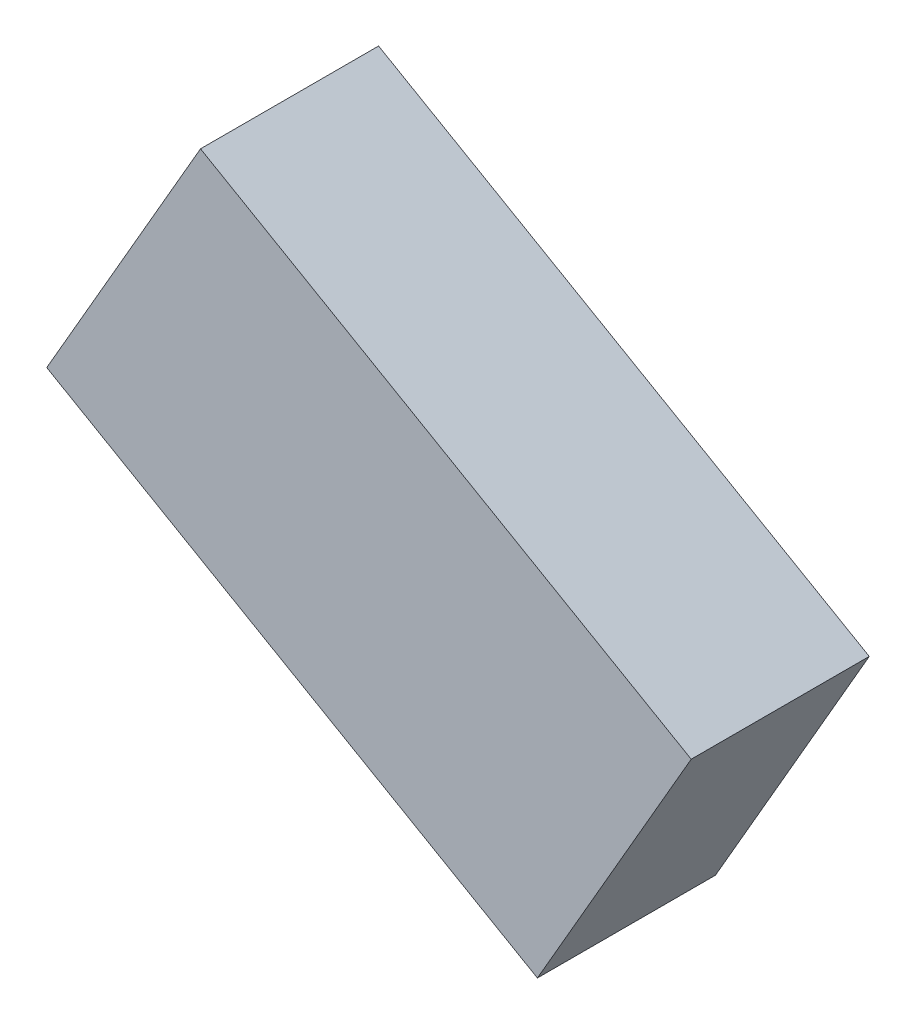
ISO-10303-21;
HEADER;
FILE_DESCRIPTION(('STEP AP214'),'2;1');
FILE_NAME('part.step','',(''),(''),'','','');
FILE_SCHEMA(('AUTOMOTIVE_DESIGN { 1 0 10303 214 1 1 1 1 }'));
ENDSEC;
DATA;
#1=APPLICATION_CONTEXT('core data for automotive mechanical design processes');
#2=APPLICATION_PROTOCOL_DEFINITION('international standard','automotive_design',2000,#1);
#3=PRODUCT_CONTEXT('',#1,'mechanical');
#4=PRODUCT('Part','Part','',(#3));
#5=PRODUCT_RELATED_PRODUCT_CATEGORY('part','',(#4));
#6=PRODUCT_DEFINITION_FORMATION('','',#4);
#7=PRODUCT_DEFINITION_CONTEXT('part definition',#1,'design');
#8=PRODUCT_DEFINITION('design','',#6,#7);
#9=PRODUCT_DEFINITION_SHAPE('','',#8);
#10=(LENGTH_UNIT() NAMED_UNIT(*) SI_UNIT(.MILLI.,.METRE.));
#11=(NAMED_UNIT(*) PLANE_ANGLE_UNIT() SI_UNIT($,.RADIAN.));
#12=(NAMED_UNIT(*) SI_UNIT($,.STERADIAN.) SOLID_ANGLE_UNIT());
#13=UNCERTAINTY_MEASURE_WITH_UNIT(LENGTH_MEASURE(1.E-05),#10,'distance_accuracy_value','');
#14=(GEOMETRIC_REPRESENTATION_CONTEXT(3) GLOBAL_UNCERTAINTY_ASSIGNED_CONTEXT((#13)) GLOBAL_UNIT_ASSIGNED_CONTEXT((#10,
#11,#12)) REPRESENTATION_CONTEXT('',''));
#15=CARTESIAN_POINT('',(0.,0.,0.));
#16=DIRECTION('',(0.,0.,1.));
#17=DIRECTION('',(1.,0.,0.));
#18=AXIS2_PLACEMENT_3D('',#15,#16,#17);
#19=CARTESIAN_POINT('',(-0.99527106,0.0261366,0.5499989));
#20=DIRECTION('',(0.,0.,-1.));
#21=DIRECTION('',(-1.,0.,0.));
#22=AXIS2_PLACEMENT_3D('',#19,#20,#21);
#23=PLANE('',#22);
#24=DIRECTION('',(-0.499998098330148,-0.866026501711256,0.));
#25=VECTOR('',#24,1.);
#26=CARTESIAN_POINT('',(0.52027328,-0.84886292,0.5499989));
#27=LINE('',#26,#25);
#28=CARTESIAN_POINT('',(0.520273280000034,-0.848862919999941,0.5499989));
#29=VERTEX_POINT('',#28);
#30=CARTESIAN_POINT('',(0.995273600000001,-0.0261340600000004,0.5499989));
#31=VERTEX_POINT('',#30);
#32=EDGE_CURVE('E54',#29,#31,#27,.F.);
#33=ORIENTED_EDGE('',*,*,#32,.T.);
#34=DIRECTION('',(0.866026134380101,-0.499998734569058,0.));
#35=VECTOR('',#34,1.);
#36=CARTESIAN_POINT('',(0.9952736,-0.02613406,0.5499989));
#37=LINE('',#36,#35);
#38=CARTESIAN_POINT('',(-0.520270740000045,0.848862919999921,0.5499989));
#39=VERTEX_POINT('',#38);
#40=EDGE_CURVE('E56',#31,#39,#37,.F.);
#41=ORIENTED_EDGE('',*,*,#40,.T.);
#42=DIRECTION('',(0.499999256063104,0.86602583329618,0.));
#43=VECTOR('',#42,1.);
#44=CARTESIAN_POINT('',(-0.52027074,0.84886292,0.5499989));
#45=LINE('',#44,#43);
#46=CARTESIAN_POINT('',(-0.995271059999819,0.0261365999998956,0.5499989));
#47=VERTEX_POINT('',#46);
#48=EDGE_CURVE('E19',#39,#47,#45,.F.);
#49=ORIENTED_EDGE('',*,*,#48,.T.);
#50=DIRECTION('',(-0.866025505893321,0.499999823142186,0.));
#51=VECTOR('',#50,1.);
#52=CARTESIAN_POINT('',(-0.99527106,0.0261366,0.5499989));
#53=LINE('',#52,#51);
#54=EDGE_CURVE('E79',#47,#29,#53,.F.);
#55=ORIENTED_EDGE('',*,*,#54,.T.);
#56=EDGE_LOOP('',(#33,#41,#49,#55));
#57=FACE_BOUND('',#56,.T.);
#58=ADVANCED_FACE('F16',(#57),#23,.F.);
#59=CARTESIAN_POINT('',(-0.52027074,0.84886292,0.));
#60=DIRECTION('',(0.86602583329618,-0.499999256063104,0.));
#61=DIRECTION('',(0.499999256063104,0.86602583329618,0.));
#62=AXIS2_PLACEMENT_3D('',#59,#60,#61);
#63=PLANE('',#62);
#64=DIRECTION('',(0.,0.,1.));
#65=VECTOR('',#64,1.);
#66=CARTESIAN_POINT('',(-0.99527106,0.0261366,0.));
#67=LINE('',#66,#65);
#68=CARTESIAN_POINT('',(-0.995271059999819,0.0261365999998956,0.));
#69=VERTEX_POINT('',#68);
#70=EDGE_CURVE('E67',#69,#47,#67,.T.);
#71=ORIENTED_EDGE('',*,*,#70,.T.);
#72=ORIENTED_EDGE('',*,*,#48,.F.);
#73=DIRECTION('',(0.,0.,1.));
#74=VECTOR('',#73,1.);
#75=CARTESIAN_POINT('',(-0.520270740000182,0.848862919999685,0.));
#76=LINE('',#75,#74);
#77=CARTESIAN_POINT('',(-0.520270740000045,0.848862919999921,0.));
#78=VERTEX_POINT('',#77);
#79=EDGE_CURVE('E62',#39,#78,#76,.F.);
#80=ORIENTED_EDGE('',*,*,#79,.T.);
#81=DIRECTION('',(0.499999256063484,0.86602583329596,0.));
#82=VECTOR('',#81,1.);
#83=CARTESIAN_POINT('',(-0.99527106,0.0261366,0.));
#84=LINE('',#83,#82);
#85=EDGE_CURVE('E82',#69,#78,#84,.T.);
#86=ORIENTED_EDGE('',*,*,#85,.F.);
#87=EDGE_LOOP('',(#71,#72,#80,#86));
#88=FACE_BOUND('',#87,.T.);
#89=ADVANCED_FACE('F64',(#88),#63,.F.);
#90=CARTESIAN_POINT('',(0.9952736,-0.02613406,0.));
#91=DIRECTION('',(-0.499998734569058,-0.866026134380101,0.));
#92=DIRECTION('',(0.866026134380101,-0.499998734569058,0.));
#93=AXIS2_PLACEMENT_3D('',#90,#91,#92);
#94=PLANE('',#93);
#95=ORIENTED_EDGE('',*,*,#79,.F.);
#96=ORIENTED_EDGE('',*,*,#40,.F.);
#97=DIRECTION('',(0.,0.,1.));
#98=VECTOR('',#97,1.);
#99=CARTESIAN_POINT('',(0.995273600000003,-0.0261340600000015,0.));
#100=LINE('',#99,#98);
#101=CARTESIAN_POINT('',(0.995273600000001,-0.0261340600000004,0.));
#102=VERTEX_POINT('',#101);
#103=EDGE_CURVE('E74',#31,#102,#100,.F.);
#104=ORIENTED_EDGE('',*,*,#103,.T.);
#105=DIRECTION('',(0.866026134379997,-0.499998734569238,0.));
#106=VECTOR('',#105,1.);
#107=CARTESIAN_POINT('',(-0.52027074,0.84886292,0.));
#108=LINE('',#107,#106);
#109=EDGE_CURVE('E71',#78,#102,#108,.T.);
#110=ORIENTED_EDGE('',*,*,#109,.F.);
#111=EDGE_LOOP('',(#95,#96,#104,#110));
#112=FACE_BOUND('',#111,.T.);
#113=ADVANCED_FACE('F69',(#112),#94,.F.);
#114=CARTESIAN_POINT('',(0.52027328,-0.84886292,0.));
#115=DIRECTION('',(-0.866026501711256,0.499998098330148,0.));
#116=DIRECTION('',(-0.499998098330148,-0.866026501711256,0.));
#117=AXIS2_PLACEMENT_3D('',#114,#115,#116);
#118=PLANE('',#117);
#119=ORIENTED_EDGE('',*,*,#103,.F.);
#120=ORIENTED_EDGE('',*,*,#32,.F.);
#121=DIRECTION('',(0.,0.,1.));
#122=VECTOR('',#121,1.);
#123=CARTESIAN_POINT('',(0.520273280000137,-0.848862919999764,0.));
#124=LINE('',#123,#122);
#125=CARTESIAN_POINT('',(0.520273280000034,-0.848862919999941,0.));
#126=VERTEX_POINT('',#125);
#127=EDGE_CURVE('E34',#29,#126,#124,.F.);
#128=ORIENTED_EDGE('',*,*,#127,.T.);
#129=DIRECTION('',(-0.499998098330145,-0.866026501711258,0.));
#130=VECTOR('',#129,1.);
#131=CARTESIAN_POINT('',(0.9952736,-0.02613406,0.));
#132=LINE('',#131,#130);
#133=EDGE_CURVE('E25',#102,#126,#132,.T.);
#134=ORIENTED_EDGE('',*,*,#133,.F.);
#135=EDGE_LOOP('',(#119,#120,#128,#134));
#136=FACE_BOUND('',#135,.T.);
#137=ADVANCED_FACE('F88',(#136),#118,.F.);
#138=CARTESIAN_POINT('',(-0.99527106,0.0261366,0.));
#139=DIRECTION('',(0.499999823142186,0.866025505893321,0.));
#140=DIRECTION('',(-0.866025505893321,0.499999823142186,0.));
#141=AXIS2_PLACEMENT_3D('',#138,#139,#140);
#142=PLANE('',#141);
#143=ORIENTED_EDGE('',*,*,#127,.F.);
#144=ORIENTED_EDGE('',*,*,#54,.F.);
#145=ORIENTED_EDGE('',*,*,#70,.F.);
#146=DIRECTION('',(-0.866025505893243,0.499999823142321,0.));
#147=VECTOR('',#146,1.);
#148=CARTESIAN_POINT('',(0.52027328,-0.84886292,0.));
#149=LINE('',#148,#147);
#150=EDGE_CURVE('E11',#126,#69,#149,.T.);
#151=ORIENTED_EDGE('',*,*,#150,.F.);
#152=EDGE_LOOP('',(#143,#144,#145,#151));
#153=FACE_BOUND('',#152,.T.);
#154=ADVANCED_FACE('F90',(#153),#142,.F.);
#155=CARTESIAN_POINT('',(-0.99527106,0.0261366,0.));
#156=DIRECTION('',(0.,0.,-1.));
#157=DIRECTION('',(-1.,0.,0.));
#158=AXIS2_PLACEMENT_3D('',#155,#156,#157);
#159=PLANE('',#158);
#160=ORIENTED_EDGE('',*,*,#133,.T.);
#161=ORIENTED_EDGE('',*,*,#150,.T.);
#162=ORIENTED_EDGE('',*,*,#85,.T.);
#163=ORIENTED_EDGE('',*,*,#109,.T.);
#164=EDGE_LOOP('',(#160,#161,#162,#163));
#165=FACE_BOUND('',#164,.T.);
#166=ADVANCED_FACE('F87',(#165),#159,.T.);
#167=CLOSED_SHELL('',(#58,#89,#113,#137,#154,#166));
#168=MANIFOLD_SOLID_BREP('B1',#167);
#169=ADVANCED_BREP_SHAPE_REPRESENTATION('',(#18,#168),#14);
#170=SHAPE_DEFINITION_REPRESENTATION(#9,#169);
ENDSEC;
END-ISO-10303-21;
